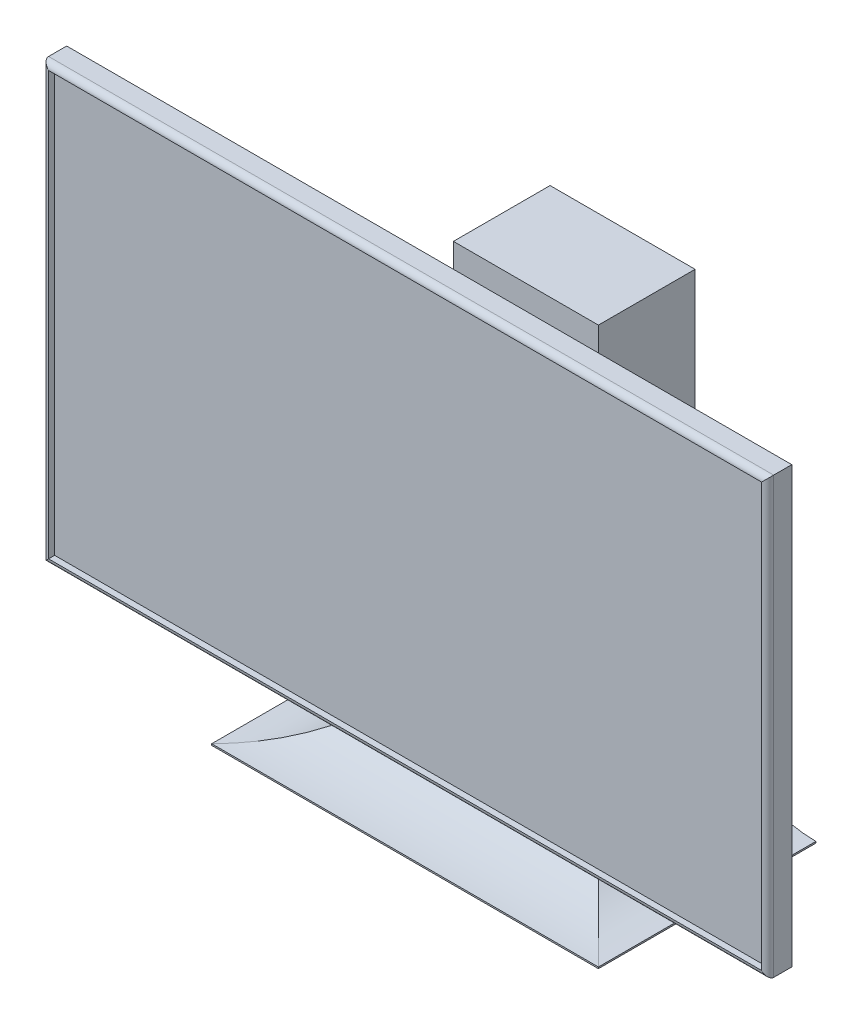
ISO-10303-21;
HEADER;
FILE_DESCRIPTION(('STEP AP214'),'2;1');
FILE_NAME('part.step','',(''),(''),'','','');
FILE_SCHEMA(('AUTOMOTIVE_DESIGN { 1 0 10303 214 1 1 1 1 }'));
ENDSEC;
DATA;
#1=APPLICATION_CONTEXT('core data for automotive mechanical design processes');
#2=APPLICATION_PROTOCOL_DEFINITION('international standard','automotive_design',2000,#1);
#3=PRODUCT_CONTEXT('',#1,'mechanical');
#4=PRODUCT('Part','Part','',(#3));
#5=PRODUCT_RELATED_PRODUCT_CATEGORY('part','',(#4));
#6=PRODUCT_DEFINITION_FORMATION('','',#4);
#7=PRODUCT_DEFINITION_CONTEXT('part definition',#1,'design');
#8=PRODUCT_DEFINITION('design','',#6,#7);
#9=PRODUCT_DEFINITION_SHAPE('','',#8);
#10=(LENGTH_UNIT() NAMED_UNIT(*) SI_UNIT(.MILLI.,.METRE.));
#11=(NAMED_UNIT(*) PLANE_ANGLE_UNIT() SI_UNIT($,.RADIAN.));
#12=(NAMED_UNIT(*) SI_UNIT($,.STERADIAN.) SOLID_ANGLE_UNIT());
#13=UNCERTAINTY_MEASURE_WITH_UNIT(LENGTH_MEASURE(1.E-05),#10,'distance_accuracy_value','');
#14=(GEOMETRIC_REPRESENTATION_CONTEXT(3) GLOBAL_UNCERTAINTY_ASSIGNED_CONTEXT((#13)) GLOBAL_UNIT_ASSIGNED_CONTEXT((#10,
#11,#12)) REPRESENTATION_CONTEXT('',''));
#15=CARTESIAN_POINT('',(0.,0.,0.));
#16=DIRECTION('',(0.,0.,1.));
#17=DIRECTION('',(1.,0.,0.));
#18=AXIS2_PLACEMENT_3D('',#15,#16,#17);
#19=CARTESIAN_POINT('',(63.5,102.39375,-63.5));
#20=DIRECTION('',(0.,0.,-1.));
#21=DIRECTION('',(-1.,0.,0.));
#22=AXIS2_PLACEMENT_3D('',#19,#20,#21);
#23=PLANE('',#22);
#24=DIRECTION('',(1.,0.,0.));
#25=VECTOR('',#24,1.);
#26=CARTESIAN_POINT('',(63.5,102.39375,-63.5));
#27=LINE('',#26,#25);
#28=CARTESIAN_POINT('',(63.5,102.39375,-63.5));
#29=VERTEX_POINT('',#28);
#30=CARTESIAN_POINT('',(139.7,102.39375,-63.5));
#31=VERTEX_POINT('',#30);
#32=EDGE_CURVE('E226',#29,#31,#27,.T.);
#33=ORIENTED_EDGE('',*,*,#32,.F.);
#34=DIRECTION('',(0.,-1.,0.));
#35=VECTOR('',#34,1.);
#36=CARTESIAN_POINT('',(63.5,102.39375,-63.5));
#37=LINE('',#36,#35);
#38=CARTESIAN_POINT('',(63.5,64.29375,-63.5));
#39=VERTEX_POINT('',#38);
#40=EDGE_CURVE('E272',#29,#39,#37,.T.);
#41=ORIENTED_EDGE('',*,*,#40,.T.);
#42=DIRECTION('',(1.,0.,0.));
#43=VECTOR('',#42,1.);
#44=CARTESIAN_POINT('',(139.7,64.29375,-63.5));
#45=LINE('',#44,#43);
#46=CARTESIAN_POINT('',(139.7,64.29375,-63.5));
#47=VERTEX_POINT('',#46);
#48=EDGE_CURVE('E318',#39,#47,#45,.T.);
#49=ORIENTED_EDGE('',*,*,#48,.T.);
#50=DIRECTION('',(0.,-1.,0.));
#51=VECTOR('',#50,1.);
#52=CARTESIAN_POINT('',(139.7,102.39375,-63.5));
#53=LINE('',#52,#51);
#54=EDGE_CURVE('E273',#31,#47,#53,.T.);
#55=ORIENTED_EDGE('',*,*,#54,.F.);
#56=EDGE_LOOP('',(#33,#41,#49,#55));
#57=FACE_BOUND('',#56,.T.);
#58=ADVANCED_FACE('F34',(#57),#23,.F.);
#59=DIRECTION('',(-1.,0.,0.));
#60=VECTOR('',#59,1.);
#61=CARTESIAN_POINT('',(63.5,140.49375,-63.5));
#62=LINE('',#61,#60);
#63=CARTESIAN_POINT('',(139.7,140.49375,-63.5));
#64=VERTEX_POINT('',#63);
#65=CARTESIAN_POINT('',(63.5,140.49375,-63.5));
#66=VERTEX_POINT('',#65);
#67=EDGE_CURVE('E231',#64,#66,#62,.T.);
#68=ORIENTED_EDGE('',*,*,#67,.F.);
#69=CARTESIAN_POINT('',(139.7,229.39375,-63.5));
#70=VERTEX_POINT('',#69);
#71=EDGE_CURVE('E269',#70,#64,#53,.T.);
#72=ORIENTED_EDGE('',*,*,#71,.F.);
#73=DIRECTION('',(1.,0.,0.));
#74=VECTOR('',#73,1.);
#75=CARTESIAN_POINT('',(139.7,229.39375,-63.5));
#76=LINE('',#75,#74);
#77=CARTESIAN_POINT('',(63.5,229.39375,-63.5));
#78=VERTEX_POINT('',#77);
#79=EDGE_CURVE('E265',#78,#70,#76,.T.);
#80=ORIENTED_EDGE('',*,*,#79,.F.);
#81=EDGE_CURVE('E274',#78,#66,#37,.T.);
#82=ORIENTED_EDGE('',*,*,#81,.T.);
#83=EDGE_LOOP('',(#68,#72,#80,#82));
#84=FACE_BOUND('',#83,.T.);
#85=ADVANCED_FACE('F386',(#84),#23,.F.);
#86=CARTESIAN_POINT('',(0.,0.79375,0.));
#87=DIRECTION('',(1.,0.,0.));
#88=DIRECTION('',(0.,0.,-1.));
#89=AXIS2_PLACEMENT_3D('',#86,#87,#88);
#90=PLANE('',#89);
#91=DIRECTION('',(0.,0.,1.));
#92=VECTOR('',#91,1.);
#93=CARTESIAN_POINT('',(0.,0.,0.));
#94=LINE('',#93,#92);
#95=CARTESIAN_POINT('',(0.,0.,-114.3));
#96=VERTEX_POINT('',#95);
#97=CARTESIAN_POINT('',(0.,0.,0.));
#98=VERTEX_POINT('',#97);
#99=EDGE_CURVE('E282',#96,#98,#94,.T.);
#100=ORIENTED_EDGE('',*,*,#99,.T.);
#101=DIRECTION('',(0.,-1.,0.));
#102=VECTOR('',#101,1.);
#103=CARTESIAN_POINT('',(0.,0.79375,0.));
#104=LINE('',#103,#102);
#105=CARTESIAN_POINT('',(0.,0.79375,0.));
#106=VERTEX_POINT('',#105);
#107=EDGE_CURVE('E309',#106,#98,#104,.T.);
#108=ORIENTED_EDGE('',*,*,#107,.F.);
#109=DIRECTION('',(0.,0.,1.));
#110=VECTOR('',#109,1.);
#111=CARTESIAN_POINT('',(0.,0.79375,0.));
#112=LINE('',#111,#110);
#113=CARTESIAN_POINT('',(0.,0.79375,-114.3));
#114=VERTEX_POINT('',#113);
#115=EDGE_CURVE('E283',#114,#106,#112,.T.);
#116=ORIENTED_EDGE('',*,*,#115,.F.);
#117=DIRECTION('',(0.,-1.,0.));
#118=VECTOR('',#117,1.);
#119=CARTESIAN_POINT('',(0.,0.79375,-114.3));
#120=LINE('',#119,#118);
#121=EDGE_CURVE('E293',#114,#96,#120,.T.);
#122=ORIENTED_EDGE('',*,*,#121,.T.);
#123=EDGE_LOOP('',(#100,#108,#116,#122));
#124=FACE_BOUND('',#123,.T.);
#125=ADVANCED_FACE('F392',(#124),#90,.F.);
#126=CARTESIAN_POINT('',(0.,0.79375,0.));
#127=DIRECTION('',(0.,0.,-1.));
#128=DIRECTION('',(-1.,0.,0.));
#129=AXIS2_PLACEMENT_3D('',#126,#127,#128);
#130=PLANE('',#129);
#131=DIRECTION('',(1.,0.,0.));
#132=VECTOR('',#131,1.);
#133=CARTESIAN_POINT('',(0.,0.,0.));
#134=LINE('',#133,#132);
#135=CARTESIAN_POINT('',(203.2,0.,0.));
#136=VERTEX_POINT('',#135);
#137=EDGE_CURVE('E296',#98,#136,#134,.T.);
#138=ORIENTED_EDGE('',*,*,#137,.T.);
#139=DIRECTION('',(0.,-1.,0.));
#140=VECTOR('',#139,1.);
#141=CARTESIAN_POINT('',(203.2,0.79375,0.));
#142=LINE('',#141,#140);
#143=CARTESIAN_POINT('',(203.2,0.79375,0.));
#144=VERTEX_POINT('',#143);
#145=EDGE_CURVE('E306',#144,#136,#142,.T.);
#146=ORIENTED_EDGE('',*,*,#145,.F.);
#147=DIRECTION('',(1.,0.,0.));
#148=VECTOR('',#147,1.);
#149=CARTESIAN_POINT('',(0.,0.79375,0.));
#150=LINE('',#149,#148);
#151=EDGE_CURVE('E286',#106,#144,#150,.T.);
#152=ORIENTED_EDGE('',*,*,#151,.F.);
#153=ORIENTED_EDGE('',*,*,#107,.T.);
#154=EDGE_LOOP('',(#138,#146,#152,#153));
#155=FACE_BOUND('',#154,.T.);
#156=ADVANCED_FACE('F418',(#155),#130,.F.);
#157=CARTESIAN_POINT('',(203.2,0.79375,0.));
#158=DIRECTION('',(-1.,0.,0.));
#159=DIRECTION('',(0.,0.,1.));
#160=AXIS2_PLACEMENT_3D('',#157,#158,#159);
#161=PLANE('',#160);
#162=DIRECTION('',(0.,0.,-1.));
#163=VECTOR('',#162,1.);
#164=CARTESIAN_POINT('',(203.2,0.,0.));
#165=LINE('',#164,#163);
#166=CARTESIAN_POINT('',(203.2,0.,-114.3));
#167=VERTEX_POINT('',#166);
#168=EDGE_CURVE('E298',#136,#167,#165,.T.);
#169=ORIENTED_EDGE('',*,*,#168,.T.);
#170=DIRECTION('',(0.,-1.,0.));
#171=VECTOR('',#170,1.);
#172=CARTESIAN_POINT('',(203.2,0.79375,-114.3));
#173=LINE('',#172,#171);
#174=CARTESIAN_POINT('',(203.2,0.79375,-114.3));
#175=VERTEX_POINT('',#174);
#176=EDGE_CURVE('E303',#175,#167,#173,.T.);
#177=ORIENTED_EDGE('',*,*,#176,.F.);
#178=DIRECTION('',(0.,0.,-1.));
#179=VECTOR('',#178,1.);
#180=CARTESIAN_POINT('',(203.2,0.79375,0.));
#181=LINE('',#180,#179);
#182=EDGE_CURVE('E290',#144,#175,#181,.T.);
#183=ORIENTED_EDGE('',*,*,#182,.F.);
#184=ORIENTED_EDGE('',*,*,#145,.T.);
#185=EDGE_LOOP('',(#169,#177,#183,#184));
#186=FACE_BOUND('',#185,.T.);
#187=ADVANCED_FACE('F414',(#186),#161,.F.);
#188=CARTESIAN_POINT('',(0.,0.79375,-114.3));
#189=DIRECTION('',(0.,0.,1.));
#190=DIRECTION('',(1.,0.,0.));
#191=AXIS2_PLACEMENT_3D('',#188,#189,#190);
#192=PLANE('',#191);
#193=DIRECTION('',(-1.,0.,0.));
#194=VECTOR('',#193,1.);
#195=CARTESIAN_POINT('',(0.,0.,-114.3));
#196=LINE('',#195,#194);
#197=EDGE_CURVE('E287',#167,#96,#196,.T.);
#198=ORIENTED_EDGE('',*,*,#197,.T.);
#199=ORIENTED_EDGE('',*,*,#121,.F.);
#200=CARTESIAN_POINT('',(0.,64.29375,-114.3));
#201=DIRECTION('',(0.,0.,1.));
#202=DIRECTION('',(1.,0.,0.));
#203=AXIS2_PLACEMENT_3D('',#200,#201,#202);
#204=CIRCLE('',#203,63.5);
#205=CARTESIAN_POINT('',(63.5,64.29375,-114.3));
#206=VERTEX_POINT('',#205);
#207=EDGE_CURVE('E323',#114,#206,#204,.T.);
#208=ORIENTED_EDGE('',*,*,#207,.T.);
#209=DIRECTION('',(0.,-1.,0.));
#210=VECTOR('',#209,1.);
#211=CARTESIAN_POINT('',(63.5,102.39375,-114.3));
#212=LINE('',#211,#210);
#213=CARTESIAN_POINT('',(63.5,229.39375,-114.3));
#214=VERTEX_POINT('',#213);
#215=EDGE_CURVE('E276',#214,#206,#212,.T.);
#216=ORIENTED_EDGE('',*,*,#215,.F.);
#217=DIRECTION('',(-1.,0.,0.));
#218=VECTOR('',#217,1.);
#219=CARTESIAN_POINT('',(139.7,229.39375,-114.3));
#220=LINE('',#219,#218);
#221=CARTESIAN_POINT('',(139.7,229.39375,-114.3));
#222=VERTEX_POINT('',#221);
#223=EDGE_CURVE('E259',#222,#214,#220,.T.);
#224=ORIENTED_EDGE('',*,*,#223,.F.);
#225=DIRECTION('',(0.,-1.,0.));
#226=VECTOR('',#225,1.);
#227=CARTESIAN_POINT('',(139.7,102.39375,-114.3));
#228=LINE('',#227,#226);
#229=CARTESIAN_POINT('',(139.7,64.29375,-114.3));
#230=VERTEX_POINT('',#229);
#231=EDGE_CURVE('E279',#222,#230,#228,.T.);
#232=ORIENTED_EDGE('',*,*,#231,.T.);
#233=CARTESIAN_POINT('',(203.2,64.29375,-114.3));
#234=DIRECTION('',(0.,0.,1.));
#235=DIRECTION('',(1.,0.,0.));
#236=AXIS2_PLACEMENT_3D('',#233,#234,#235);
#237=CIRCLE('',#236,63.5);
#238=EDGE_CURVE('E321',#230,#175,#237,.T.);
#239=ORIENTED_EDGE('',*,*,#238,.T.);
#240=ORIENTED_EDGE('',*,*,#176,.T.);
#241=EDGE_LOOP('',(#198,#199,#208,#216,#224,#232,#239,#240));
#242=FACE_BOUND('',#241,.T.);
#243=ADVANCED_FACE('F410',(#242),#192,.F.);
#244=CARTESIAN_POINT('',(0.,0.,0.));
#245=DIRECTION('',(0.,-1.,0.));
#246=DIRECTION('',(0.,0.,-1.));
#247=AXIS2_PLACEMENT_3D('',#244,#245,#246);
#248=PLANE('',#247);
#249=ORIENTED_EDGE('',*,*,#99,.F.);
#250=ORIENTED_EDGE('',*,*,#197,.F.);
#251=ORIENTED_EDGE('',*,*,#168,.F.);
#252=ORIENTED_EDGE('',*,*,#137,.F.);
#253=EDGE_LOOP('',(#249,#250,#251,#252));
#254=FACE_BOUND('',#253,.T.);
#255=ADVANCED_FACE('F406',(#254),#248,.T.);
#256=CARTESIAN_POINT('',(139.7,102.39375,-63.5));
#257=DIRECTION('',(-1.,0.,0.));
#258=DIRECTION('',(0.,0.,1.));
#259=AXIS2_PLACEMENT_3D('',#256,#257,#258);
#260=PLANE('',#259);
#261=ORIENTED_EDGE('',*,*,#71,.T.);
#262=DIRECTION('',(0.,0.,-1.));
#263=VECTOR('',#262,1.);
#264=CARTESIAN_POINT('',(139.7,140.49375,-12.7));
#265=LINE('',#264,#263);
#266=CARTESIAN_POINT('',(139.7,140.49375,-12.7));
#267=VERTEX_POINT('',#266);
#268=EDGE_CURVE('E247',#267,#64,#265,.T.);
#269=ORIENTED_EDGE('',*,*,#268,.F.);
#270=DIRECTION('',(0.,1.,0.));
#271=VECTOR('',#270,1.);
#272=CARTESIAN_POINT('',(139.7,102.39375,-12.7));
#273=LINE('',#272,#271);
#274=CARTESIAN_POINT('',(139.7,102.39375,-12.7));
#275=VERTEX_POINT('',#274);
#276=EDGE_CURVE('E234',#275,#267,#273,.T.);
#277=ORIENTED_EDGE('',*,*,#276,.F.);
#278=DIRECTION('',(0.,0.,-1.));
#279=VECTOR('',#278,1.);
#280=CARTESIAN_POINT('',(139.7,102.39375,-12.7));
#281=LINE('',#280,#279);
#282=EDGE_CURVE('E250',#275,#31,#281,.T.);
#283=ORIENTED_EDGE('',*,*,#282,.T.);
#284=ORIENTED_EDGE('',*,*,#54,.T.);
#285=DIRECTION('',(0.,0.,-1.));
#286=VECTOR('',#285,1.);
#287=CARTESIAN_POINT('',(139.7,64.29375,-114.3));
#288=LINE('',#287,#286);
#289=EDGE_CURVE('E312',#47,#230,#288,.T.);
#290=ORIENTED_EDGE('',*,*,#289,.T.);
#291=ORIENTED_EDGE('',*,*,#231,.F.);
#292=DIRECTION('',(0.,0.,-1.));
#293=VECTOR('',#292,1.);
#294=CARTESIAN_POINT('',(139.7,229.39375,-114.3));
#295=LINE('',#294,#293);
#296=EDGE_CURVE('E256',#70,#222,#295,.T.);
#297=ORIENTED_EDGE('',*,*,#296,.F.);
#298=EDGE_LOOP('',(#261,#269,#277,#283,#284,#290,#291,#297));
#299=FACE_BOUND('',#298,.T.);
#300=ADVANCED_FACE('F402',(#299),#260,.F.);
#301=CARTESIAN_POINT('',(63.5,102.39375,-63.5));
#302=DIRECTION('',(1.,0.,0.));
#303=DIRECTION('',(0.,0.,-1.));
#304=AXIS2_PLACEMENT_3D('',#301,#302,#303);
#305=PLANE('',#304);
#306=ORIENTED_EDGE('',*,*,#215,.T.);
#307=DIRECTION('',(0.,0.,1.));
#308=VECTOR('',#307,1.);
#309=CARTESIAN_POINT('',(63.5,64.29375,-63.5));
#310=LINE('',#309,#308);
#311=EDGE_CURVE('E315',#206,#39,#310,.T.);
#312=ORIENTED_EDGE('',*,*,#311,.T.);
#313=ORIENTED_EDGE('',*,*,#40,.F.);
#314=DIRECTION('',(0.,0.,-1.));
#315=VECTOR('',#314,1.);
#316=CARTESIAN_POINT('',(63.5,102.39375,-12.7));
#317=LINE('',#316,#315);
#318=CARTESIAN_POINT('',(63.5,102.39375,-12.7));
#319=VERTEX_POINT('',#318);
#320=EDGE_CURVE('E253',#319,#29,#317,.T.);
#321=ORIENTED_EDGE('',*,*,#320,.F.);
#322=DIRECTION('',(0.,-1.,0.));
#323=VECTOR('',#322,1.);
#324=CARTESIAN_POINT('',(63.5,102.39375,-12.7));
#325=LINE('',#324,#323);
#326=CARTESIAN_POINT('',(63.5,140.49375,-12.7));
#327=VERTEX_POINT('',#326);
#328=EDGE_CURVE('E227',#327,#319,#325,.T.);
#329=ORIENTED_EDGE('',*,*,#328,.F.);
#330=DIRECTION('',(0.,0.,-1.));
#331=VECTOR('',#330,1.);
#332=CARTESIAN_POINT('',(63.5,140.49375,-12.7));
#333=LINE('',#332,#331);
#334=EDGE_CURVE('E240',#327,#66,#333,.T.);
#335=ORIENTED_EDGE('',*,*,#334,.T.);
#336=ORIENTED_EDGE('',*,*,#81,.F.);
#337=DIRECTION('',(0.,0.,1.));
#338=VECTOR('',#337,1.);
#339=CARTESIAN_POINT('',(63.5,229.39375,-114.3));
#340=LINE('',#339,#338);
#341=EDGE_CURVE('E262',#214,#78,#340,.T.);
#342=ORIENTED_EDGE('',*,*,#341,.F.);
#343=EDGE_LOOP('',(#306,#312,#313,#321,#329,#335,#336,#342));
#344=FACE_BOUND('',#343,.T.);
#345=ADVANCED_FACE('F398',(#344),#305,.F.);
#346=CARTESIAN_POINT('',(0.,64.29375,-63.5));
#347=DIRECTION('',(0.,0.,-1.));
#348=DIRECTION('',(-1.,0.,0.));
#349=AXIS2_PLACEMENT_3D('',#346,#347,#348);
#350=CYLINDRICAL_SURFACE('',#349,63.5);
#351=ORIENTED_EDGE('',*,*,#207,.F.);
#352=ORIENTED_EDGE('',*,*,#115,.T.);
#353=CARTESIAN_POINT('',(0.,64.29375,0.));
#354=DIRECTION('',(-0.707106781186548,0.,-0.707106781186548));
#355=DIRECTION('',(-0.707106781186547,0.,0.707106781186547));
#356=AXIS2_PLACEMENT_3D('',#353,#354,#355);
#357=ELLIPSE('',#356,89.8025612106916,63.5);
#358=EDGE_CURVE('E328',#39,#106,#357,.T.);
#359=ORIENTED_EDGE('',*,*,#358,.F.);
#360=ORIENTED_EDGE('',*,*,#311,.F.);
#361=EDGE_LOOP('',(#351,#352,#359,#360));
#362=FACE_BOUND('',#361,.T.);
#363=ADVANCED_FACE('F401',(#362),#350,.F.);
#364=CARTESIAN_POINT('',(63.5,64.29375,0.));
#365=DIRECTION('',(-1.,0.,0.));
#366=DIRECTION('',(0.,0.,1.));
#367=AXIS2_PLACEMENT_3D('',#364,#365,#366);
#368=CYLINDRICAL_SURFACE('',#367,63.5);
#369=ORIENTED_EDGE('',*,*,#358,.T.);
#370=ORIENTED_EDGE('',*,*,#151,.T.);
#371=CARTESIAN_POINT('',(203.2,64.29375,0.));
#372=DIRECTION('',(-0.707106781186547,0.,0.707106781186548));
#373=DIRECTION('',(-0.707106781186548,0.,-0.707106781186547));
#374=AXIS2_PLACEMENT_3D('',#371,#372,#373);
#375=ELLIPSE('',#374,89.8025612106915,63.5);
#376=EDGE_CURVE('E268',#47,#144,#375,.T.);
#377=ORIENTED_EDGE('',*,*,#376,.F.);
#378=ORIENTED_EDGE('',*,*,#48,.F.);
#379=EDGE_LOOP('',(#369,#370,#377,#378));
#380=FACE_BOUND('',#379,.T.);
#381=ADVANCED_FACE('F429',(#380),#368,.F.);
#382=CARTESIAN_POINT('',(203.2,64.29375,-63.5));
#383=DIRECTION('',(0.,0.,1.));
#384=DIRECTION('',(1.,0.,0.));
#385=AXIS2_PLACEMENT_3D('',#382,#383,#384);
#386=CYLINDRICAL_SURFACE('',#385,63.5);
#387=ORIENTED_EDGE('',*,*,#376,.T.);
#388=ORIENTED_EDGE('',*,*,#182,.T.);
#389=ORIENTED_EDGE('',*,*,#238,.F.);
#390=ORIENTED_EDGE('',*,*,#289,.F.);
#391=EDGE_LOOP('',(#387,#388,#389,#390));
#392=FACE_BOUND('',#391,.T.);
#393=ADVANCED_FACE('F426',(#392),#386,.F.);
#394=CARTESIAN_POINT('',(0.,229.39375,0.));
#395=DIRECTION('',(0.,-1.,0.));
#396=DIRECTION('',(0.,0.,-1.));
#397=AXIS2_PLACEMENT_3D('',#394,#395,#396);
#398=PLANE('',#397);
#399=ORIENTED_EDGE('',*,*,#296,.T.);
#400=ORIENTED_EDGE('',*,*,#223,.T.);
#401=ORIENTED_EDGE('',*,*,#341,.T.);
#402=ORIENTED_EDGE('',*,*,#79,.T.);
#403=EDGE_LOOP('',(#399,#400,#401,#402));
#404=FACE_BOUND('',#403,.T.);
#405=ADVANCED_FACE('F396',(#404),#398,.F.);
#406=CARTESIAN_POINT('',(63.5,102.39375,-12.7));
#407=DIRECTION('',(0.,1.,0.));
#408=DIRECTION('',(0.,0.,1.));
#409=AXIS2_PLACEMENT_3D('',#406,#407,#408);
#410=PLANE('',#409);
#411=ORIENTED_EDGE('',*,*,#32,.T.);
#412=ORIENTED_EDGE('',*,*,#282,.F.);
#413=DIRECTION('',(1.,0.,0.));
#414=VECTOR('',#413,1.);
#415=CARTESIAN_POINT('',(63.5,102.39375,-12.7));
#416=LINE('',#415,#414);
#417=EDGE_CURVE('E230',#319,#275,#416,.T.);
#418=ORIENTED_EDGE('',*,*,#417,.F.);
#419=ORIENTED_EDGE('',*,*,#320,.T.);
#420=EDGE_LOOP('',(#411,#412,#418,#419));
#421=FACE_BOUND('',#420,.T.);
#422=ADVANCED_FACE('F463',(#421),#410,.F.);
#423=CARTESIAN_POINT('',(63.5,140.49375,-12.7));
#424=DIRECTION('',(0.,-1.,0.));
#425=DIRECTION('',(0.,0.,-1.));
#426=AXIS2_PLACEMENT_3D('',#423,#424,#425);
#427=PLANE('',#426);
#428=ORIENTED_EDGE('',*,*,#67,.T.);
#429=ORIENTED_EDGE('',*,*,#334,.F.);
#430=DIRECTION('',(-1.,0.,0.));
#431=VECTOR('',#430,1.);
#432=CARTESIAN_POINT('',(63.5,140.49375,-12.7));
#433=LINE('',#432,#431);
#434=EDGE_CURVE('E237',#267,#327,#433,.T.);
#435=ORIENTED_EDGE('',*,*,#434,.F.);
#436=ORIENTED_EDGE('',*,*,#268,.T.);
#437=EDGE_LOOP('',(#428,#429,#435,#436));
#438=FACE_BOUND('',#437,.T.);
#439=ADVANCED_FACE('F461',(#438),#427,.F.);
#440=CARTESIAN_POINT('',(0.,0.,-12.7));
#441=DIRECTION('',(0.,0.,-1.));
#442=DIRECTION('',(-1.,0.,0.));
#443=AXIS2_PLACEMENT_3D('',#440,#441,#442);
#444=PLANE('',#443);
#445=DIRECTION('',(0.,1.,0.));
#446=VECTOR('',#445,1.);
#447=CARTESIAN_POINT('',(292.1,38.89375,-12.7));
#448=LINE('',#447,#446);
#449=CARTESIAN_POINT('',(292.1,38.89375,-12.7));
#450=VERTEX_POINT('',#449);
#451=CARTESIAN_POINT('',(292.1,267.49375,-12.7));
#452=VERTEX_POINT('',#451);
#453=EDGE_CURVE('E206',#450,#452,#448,.T.);
#454=ORIENTED_EDGE('',*,*,#453,.F.);
#455=DIRECTION('',(1.,0.,0.));
#456=VECTOR('',#455,1.);
#457=CARTESIAN_POINT('',(-88.9,38.89375,-12.7));
#458=LINE('',#457,#456);
#459=CARTESIAN_POINT('',(-88.9,38.89375,-12.7));
#460=VERTEX_POINT('',#459);
#461=EDGE_CURVE('E215',#460,#450,#458,.T.);
#462=ORIENTED_EDGE('',*,*,#461,.F.);
#463=DIRECTION('',(0.,-1.,0.));
#464=VECTOR('',#463,1.);
#465=CARTESIAN_POINT('',(-88.9,38.89375,-12.7));
#466=LINE('',#465,#464);
#467=CARTESIAN_POINT('',(-88.9,267.49375,-12.7));
#468=VERTEX_POINT('',#467);
#469=EDGE_CURVE('E212',#468,#460,#466,.T.);
#470=ORIENTED_EDGE('',*,*,#469,.F.);
#471=DIRECTION('',(-1.,0.,0.));
#472=VECTOR('',#471,1.);
#473=CARTESIAN_POINT('',(-88.9,267.49375,-12.7));
#474=LINE('',#473,#472);
#475=EDGE_CURVE('E209',#452,#468,#474,.T.);
#476=ORIENTED_EDGE('',*,*,#475,.F.);
#477=EDGE_LOOP('',(#454,#462,#470,#476));
#478=FACE_BOUND('',#477,.T.);
#479=ORIENTED_EDGE('',*,*,#417,.T.);
#480=ORIENTED_EDGE('',*,*,#276,.T.);
#481=ORIENTED_EDGE('',*,*,#434,.T.);
#482=ORIENTED_EDGE('',*,*,#328,.T.);
#483=EDGE_LOOP('',(#479,#480,#481,#482));
#484=FACE_BOUND('',#483,.T.);
#485=ADVANCED_FACE('F455',(#478,#484),#444,.T.);
#486=CARTESIAN_POINT('',(292.1,38.89375,0.));
#487=DIRECTION('',(-1.,0.,0.));
#488=DIRECTION('',(0.,0.,1.));
#489=AXIS2_PLACEMENT_3D('',#486,#487,#488);
#490=PLANE('',#489);
#491=DIRECTION('',(0.,0.,-1.));
#492=VECTOR('',#491,1.);
#493=CARTESIAN_POINT('',(292.1,267.49375,0.));
#494=LINE('',#493,#492);
#495=CARTESIAN_POINT('',(292.1,267.49375,-3.17500000000003));
#496=VERTEX_POINT('',#495);
#497=EDGE_CURVE('E224',#496,#452,#494,.T.);
#498=ORIENTED_EDGE('',*,*,#497,.F.);
#499=DIRECTION('',(0.,1.,0.));
#500=VECTOR('',#499,1.);
#501=CARTESIAN_POINT('',(292.1,38.89375,-3.17500000000003));
#502=LINE('',#501,#500);
#503=CARTESIAN_POINT('',(292.1,38.89375,-3.17500000000003));
#504=VERTEX_POINT('',#503);
#505=EDGE_CURVE('E11',#496,#504,#502,.F.);
#506=ORIENTED_EDGE('',*,*,#505,.T.);
#507=DIRECTION('',(0.,0.,-1.));
#508=VECTOR('',#507,1.);
#509=CARTESIAN_POINT('',(292.1,38.89375,0.));
#510=LINE('',#509,#508);
#511=EDGE_CURVE('E218',#504,#450,#510,.T.);
#512=ORIENTED_EDGE('',*,*,#511,.T.);
#513=ORIENTED_EDGE('',*,*,#453,.T.);
#514=EDGE_LOOP('',(#498,#506,#512,#513));
#515=FACE_BOUND('',#514,.T.);
#516=ADVANCED_FACE('F363',(#515),#490,.F.);
#517=CARTESIAN_POINT('',(-88.9,267.49375,0.));
#518=DIRECTION('',(0.,-1.,0.));
#519=DIRECTION('',(0.,0.,-1.));
#520=AXIS2_PLACEMENT_3D('',#517,#518,#519);
#521=PLANE('',#520);
#522=DIRECTION('',(0.,0.,-1.));
#523=VECTOR('',#522,1.);
#524=CARTESIAN_POINT('',(-88.9,267.49375,0.));
#525=LINE('',#524,#523);
#526=CARTESIAN_POINT('',(-88.9,267.49375,-3.17500000000003));
#527=VERTEX_POINT('',#526);
#528=EDGE_CURVE('E222',#527,#468,#525,.T.);
#529=ORIENTED_EDGE('',*,*,#528,.F.);
#530=DIRECTION('',(-1.,0.,0.));
#531=VECTOR('',#530,1.);
#532=CARTESIAN_POINT('',(-88.9,267.49375,-3.17500000000003));
#533=LINE('',#532,#531);
#534=EDGE_CURVE('E43',#527,#496,#533,.F.);
#535=ORIENTED_EDGE('',*,*,#534,.T.);
#536=ORIENTED_EDGE('',*,*,#497,.T.);
#537=ORIENTED_EDGE('',*,*,#475,.T.);
#538=EDGE_LOOP('',(#529,#535,#536,#537));
#539=FACE_BOUND('',#538,.T.);
#540=ADVANCED_FACE('F452',(#539),#521,.F.);
#541=CARTESIAN_POINT('',(-88.9,38.89375,0.));
#542=DIRECTION('',(1.,0.,0.));
#543=DIRECTION('',(0.,0.,-1.));
#544=AXIS2_PLACEMENT_3D('',#541,#542,#543);
#545=PLANE('',#544);
#546=DIRECTION('',(0.,0.,-1.));
#547=VECTOR('',#546,1.);
#548=CARTESIAN_POINT('',(-88.9,38.89375,0.));
#549=LINE('',#548,#547);
#550=CARTESIAN_POINT('',(-88.9,38.89375,-3.17500000000003));
#551=VERTEX_POINT('',#550);
#552=EDGE_CURVE('E220',#551,#460,#549,.T.);
#553=ORIENTED_EDGE('',*,*,#552,.F.);
#554=DIRECTION('',(0.,-1.,0.));
#555=VECTOR('',#554,1.);
#556=CARTESIAN_POINT('',(-88.9,38.89375,-3.17500000000003));
#557=LINE('',#556,#555);
#558=EDGE_CURVE('E58',#551,#527,#557,.F.);
#559=ORIENTED_EDGE('',*,*,#558,.T.);
#560=ORIENTED_EDGE('',*,*,#528,.T.);
#561=ORIENTED_EDGE('',*,*,#469,.T.);
#562=EDGE_LOOP('',(#553,#559,#560,#561));
#563=FACE_BOUND('',#562,.T.);
#564=ADVANCED_FACE('F447',(#563),#545,.F.);
#565=CARTESIAN_POINT('',(-88.9,38.89375,0.));
#566=DIRECTION('',(0.,1.,0.));
#567=DIRECTION('',(0.,0.,1.));
#568=AXIS2_PLACEMENT_3D('',#565,#566,#567);
#569=PLANE('',#568);
#570=ORIENTED_EDGE('',*,*,#511,.F.);
#571=DIRECTION('',(1.,0.,0.));
#572=VECTOR('',#571,1.);
#573=CARTESIAN_POINT('',(-88.9,38.89375,-3.17500000000003));
#574=LINE('',#573,#572);
#575=EDGE_CURVE('E339',#504,#551,#574,.F.);
#576=ORIENTED_EDGE('',*,*,#575,.T.);
#577=ORIENTED_EDGE('',*,*,#552,.T.);
#578=ORIENTED_EDGE('',*,*,#461,.T.);
#579=EDGE_LOOP('',(#570,#576,#577,#578));
#580=FACE_BOUND('',#579,.T.);
#581=ADVANCED_FACE('F366',(#580),#569,.F.);
#582=CARTESIAN_POINT('',(0.,264.31875,-3.17500000000003));
#583=DIRECTION('',(-1.,0.,0.));
#584=DIRECTION('',(0.,0.,1.));
#585=AXIS2_PLACEMENT_3D('',#582,#583,#584);
#586=CYLINDRICAL_SURFACE('',#585,3.175);
#587=CARTESIAN_POINT('',(288.925,264.31875,-3.17500000000003));
#588=DIRECTION('',(-0.707106781186547,0.707106781186547,0.));
#589=DIRECTION('',(0.707106781186547,0.707106781186547,0.));
#590=AXIS2_PLACEMENT_3D('',#587,#588,#589);
#591=ELLIPSE('',#590,4.49012806053458,3.175);
#592=CARTESIAN_POINT('',(288.925,264.31875,0.));
#593=VERTEX_POINT('',#592);
#594=EDGE_CURVE('E347',#496,#593,#591,.F.);
#595=ORIENTED_EDGE('',*,*,#594,.F.);
#596=ORIENTED_EDGE('',*,*,#534,.F.);
#597=CARTESIAN_POINT('',(-85.725,264.31875,-3.17500000000003));
#598=DIRECTION('',(-0.707106781186547,-0.707106781186547,0.));
#599=DIRECTION('',(-0.707106781186547,0.707106781186547,0.));
#600=AXIS2_PLACEMENT_3D('',#597,#598,#599);
#601=ELLIPSE('',#600,4.49012806053458,3.175);
#602=CARTESIAN_POINT('',(-85.725,264.31875,0.));
#603=VERTEX_POINT('',#602);
#604=EDGE_CURVE('E38',#603,#527,#601,.T.);
#605=ORIENTED_EDGE('',*,*,#604,.F.);
#606=DIRECTION('',(-1.,0.,0.));
#607=VECTOR('',#606,1.);
#608=CARTESIAN_POINT('',(0.,264.31875,0.));
#609=LINE('',#608,#607);
#610=EDGE_CURVE('E333',#593,#603,#609,.T.);
#611=ORIENTED_EDGE('',*,*,#610,.F.);
#612=EDGE_LOOP('',(#595,#596,#605,#611));
#613=FACE_BOUND('',#612,.T.);
#614=ADVANCED_FACE('F36',(#613),#586,.T.);
#615=CARTESIAN_POINT('',(-85.725,0.,-3.17500000000003));
#616=DIRECTION('',(0.,-1.,0.));
#617=DIRECTION('',(0.,0.,-1.));
#618=AXIS2_PLACEMENT_3D('',#615,#616,#617);
#619=CYLINDRICAL_SURFACE('',#618,3.175);
#620=ORIENTED_EDGE('',*,*,#604,.T.);
#621=ORIENTED_EDGE('',*,*,#558,.F.);
#622=CARTESIAN_POINT('',(-85.725,42.06875,-3.17500000000003));
#623=DIRECTION('',(0.707106781186547,-0.707106781186547,0.));
#624=DIRECTION('',(-0.707106781186547,-0.707106781186547,0.));
#625=AXIS2_PLACEMENT_3D('',#622,#623,#624);
#626=ELLIPSE('',#625,4.49012806053458,3.175);
#627=CARTESIAN_POINT('',(-85.725,42.06875,0.));
#628=VERTEX_POINT('',#627);
#629=EDGE_CURVE('E346',#628,#551,#626,.T.);
#630=ORIENTED_EDGE('',*,*,#629,.F.);
#631=DIRECTION('',(0.,-1.,0.));
#632=VECTOR('',#631,1.);
#633=CARTESIAN_POINT('',(-85.725,0.,0.));
#634=LINE('',#633,#632);
#635=EDGE_CURVE('E179',#603,#628,#634,.T.);
#636=ORIENTED_EDGE('',*,*,#635,.F.);
#637=EDGE_LOOP('',(#620,#621,#630,#636));
#638=FACE_BOUND('',#637,.T.);
#639=ADVANCED_FACE('F356',(#638),#619,.T.);
#640=CARTESIAN_POINT('',(288.925,0.,-3.17500000000003));
#641=DIRECTION('',(0.,1.,0.));
#642=DIRECTION('',(0.,0.,1.));
#643=AXIS2_PLACEMENT_3D('',#640,#641,#642);
#644=CYLINDRICAL_SURFACE('',#643,3.175);
#645=ORIENTED_EDGE('',*,*,#594,.T.);
#646=DIRECTION('',(0.,1.,0.));
#647=VECTOR('',#646,1.);
#648=CARTESIAN_POINT('',(288.925,0.,0.));
#649=LINE('',#648,#647);
#650=CARTESIAN_POINT('',(288.925,42.06875,0.));
#651=VERTEX_POINT('',#650);
#652=EDGE_CURVE('E325',#651,#593,#649,.T.);
#653=ORIENTED_EDGE('',*,*,#652,.F.);
#654=CARTESIAN_POINT('',(288.925,42.06875,-3.17500000000003));
#655=DIRECTION('',(0.707106781186547,0.707106781186547,0.));
#656=DIRECTION('',(-0.707106781186547,0.707106781186547,0.));
#657=AXIS2_PLACEMENT_3D('',#654,#655,#656);
#658=ELLIPSE('',#657,4.49012806053458,3.175);
#659=EDGE_CURVE('E202',#504,#651,#658,.F.);
#660=ORIENTED_EDGE('',*,*,#659,.F.);
#661=ORIENTED_EDGE('',*,*,#505,.F.);
#662=EDGE_LOOP('',(#645,#653,#660,#661));
#663=FACE_BOUND('',#662,.T.);
#664=ADVANCED_FACE('F360',(#663),#644,.T.);
#665=CARTESIAN_POINT('',(0.,42.06875,-3.17500000000003));
#666=DIRECTION('',(1.,0.,0.));
#667=DIRECTION('',(0.,0.,-1.));
#668=AXIS2_PLACEMENT_3D('',#665,#666,#667);
#669=CYLINDRICAL_SURFACE('',#668,3.175);
#670=ORIENTED_EDGE('',*,*,#629,.T.);
#671=ORIENTED_EDGE('',*,*,#575,.F.);
#672=ORIENTED_EDGE('',*,*,#659,.T.);
#673=DIRECTION('',(1.,0.,0.));
#674=VECTOR('',#673,1.);
#675=CARTESIAN_POINT('',(0.,42.06875,0.));
#676=LINE('',#675,#674);
#677=EDGE_CURVE('E337',#628,#651,#676,.T.);
#678=ORIENTED_EDGE('',*,*,#677,.F.);
#679=EDGE_LOOP('',(#670,#671,#672,#678));
#680=FACE_BOUND('',#679,.T.);
#681=ADVANCED_FACE('F370',(#680),#669,.T.);
#682=CARTESIAN_POINT('',(-85.725,42.06875,-3.175));
#683=DIRECTION('',(-1.,0.,0.));
#684=DIRECTION('',(0.,0.,1.));
#685=AXIS2_PLACEMENT_3D('',#682,#683,#684);
#686=PLANE('',#685);
#687=ORIENTED_EDGE('',*,*,#635,.T.);
#688=DIRECTION('',(0.,0.,1.));
#689=VECTOR('',#688,1.);
#690=CARTESIAN_POINT('',(-85.725,42.06875,-3.175));
#691=LINE('',#690,#689);
#692=CARTESIAN_POINT('',(-85.725,42.06875,-3.175));
#693=VERTEX_POINT('',#692);
#694=EDGE_CURVE('E172',#693,#628,#691,.T.);
#695=ORIENTED_EDGE('',*,*,#694,.F.);
#696=DIRECTION('',(0.,-1.,0.));
#697=VECTOR('',#696,1.);
#698=CARTESIAN_POINT('',(-85.725,42.06875,-3.175));
#699=LINE('',#698,#697);
#700=CARTESIAN_POINT('',(-85.725,264.31875,-3.175));
#701=VERTEX_POINT('',#700);
#702=EDGE_CURVE('E176',#701,#693,#699,.T.);
#703=ORIENTED_EDGE('',*,*,#702,.F.);
#704=DIRECTION('',(0.,0.,1.));
#705=VECTOR('',#704,1.);
#706=CARTESIAN_POINT('',(-85.725,264.31875,-3.175));
#707=LINE('',#706,#705);
#708=EDGE_CURVE('E200',#701,#603,#707,.T.);
#709=ORIENTED_EDGE('',*,*,#708,.T.);
#710=EDGE_LOOP('',(#687,#695,#703,#709));
#711=FACE_BOUND('',#710,.T.);
#712=ADVANCED_FACE('F174',(#711),#686,.F.);
#713=CARTESIAN_POINT('',(-85.725,264.31875,-3.175));
#714=DIRECTION('',(0.,1.,0.));
#715=DIRECTION('',(0.,0.,1.));
#716=AXIS2_PLACEMENT_3D('',#713,#714,#715);
#717=PLANE('',#716);
#718=ORIENTED_EDGE('',*,*,#610,.T.);
#719=ORIENTED_EDGE('',*,*,#708,.F.);
#720=DIRECTION('',(-1.,0.,0.));
#721=VECTOR('',#720,1.);
#722=CARTESIAN_POINT('',(-85.725,264.31875,-3.175));
#723=LINE('',#722,#721);
#724=CARTESIAN_POINT('',(288.925,264.31875,-3.175));
#725=VERTEX_POINT('',#724);
#726=EDGE_CURVE('E184',#725,#701,#723,.T.);
#727=ORIENTED_EDGE('',*,*,#726,.F.);
#728=DIRECTION('',(0.,0.,1.));
#729=VECTOR('',#728,1.);
#730=CARTESIAN_POINT('',(288.925,264.31875,-3.175));
#731=LINE('',#730,#729);
#732=EDGE_CURVE('E203',#725,#593,#731,.T.);
#733=ORIENTED_EDGE('',*,*,#732,.T.);
#734=EDGE_LOOP('',(#718,#719,#727,#733));
#735=FACE_BOUND('',#734,.T.);
#736=ADVANCED_FACE('F375',(#735),#717,.F.);
#737=CARTESIAN_POINT('',(288.925,42.06875,-3.175));
#738=DIRECTION('',(1.,0.,0.));
#739=DIRECTION('',(0.,0.,-1.));
#740=AXIS2_PLACEMENT_3D('',#737,#738,#739);
#741=PLANE('',#740);
#742=ORIENTED_EDGE('',*,*,#652,.T.);
#743=ORIENTED_EDGE('',*,*,#732,.F.);
#744=DIRECTION('',(0.,1.,0.));
#745=VECTOR('',#744,1.);
#746=CARTESIAN_POINT('',(288.925,42.06875,-3.175));
#747=LINE('',#746,#745);
#748=CARTESIAN_POINT('',(288.925,42.06875,-3.175));
#749=VERTEX_POINT('',#748);
#750=EDGE_CURVE('E192',#749,#725,#747,.T.);
#751=ORIENTED_EDGE('',*,*,#750,.F.);
#752=DIRECTION('',(0.,0.,1.));
#753=VECTOR('',#752,1.);
#754=CARTESIAN_POINT('',(288.925,42.06875,-3.175));
#755=LINE('',#754,#753);
#756=EDGE_CURVE('E183',#749,#651,#755,.T.);
#757=ORIENTED_EDGE('',*,*,#756,.T.);
#758=EDGE_LOOP('',(#742,#743,#751,#757));
#759=FACE_BOUND('',#758,.T.);
#760=ADVANCED_FACE('F373',(#759),#741,.F.);
#761=CARTESIAN_POINT('',(-85.725,42.06875,-3.175));
#762=DIRECTION('',(0.,-1.,0.));
#763=DIRECTION('',(0.,0.,-1.));
#764=AXIS2_PLACEMENT_3D('',#761,#762,#763);
#765=PLANE('',#764);
#766=ORIENTED_EDGE('',*,*,#677,.T.);
#767=ORIENTED_EDGE('',*,*,#756,.F.);
#768=DIRECTION('',(1.,0.,0.));
#769=VECTOR('',#768,1.);
#770=CARTESIAN_POINT('',(-85.725,42.06875,-3.175));
#771=LINE('',#770,#769);
#772=EDGE_CURVE('E187',#693,#749,#771,.T.);
#773=ORIENTED_EDGE('',*,*,#772,.F.);
#774=ORIENTED_EDGE('',*,*,#694,.T.);
#775=EDGE_LOOP('',(#766,#767,#773,#774));
#776=FACE_BOUND('',#775,.T.);
#777=ADVANCED_FACE('F188',(#776),#765,.F.);
#778=CARTESIAN_POINT('',(0.,0.,-3.175));
#779=DIRECTION('',(0.,0.,-1.));
#780=DIRECTION('',(-1.,0.,0.));
#781=AXIS2_PLACEMENT_3D('',#778,#779,#780);
#782=PLANE('',#781);
#783=ORIENTED_EDGE('',*,*,#702,.T.);
#784=ORIENTED_EDGE('',*,*,#772,.T.);
#785=ORIENTED_EDGE('',*,*,#750,.T.);
#786=ORIENTED_EDGE('',*,*,#726,.T.);
#787=EDGE_LOOP('',(#783,#784,#785,#786));
#788=FACE_BOUND('',#787,.T.);
#789=ADVANCED_FACE('F194',(#788),#782,.F.);
#790=CLOSED_SHELL('',(#58,#85,#125,#156,#187,#243,#255,#300,#345,#363,#381,#393,#405,#422,#439,
#485,#516,#540,#564,#581,#614,#639,#664,#681,#712,#736,#760,#777,#789));
#791=MANIFOLD_SOLID_BREP('B2',#790);
#792=ADVANCED_BREP_SHAPE_REPRESENTATION('',(#18,#791),#14);
#793=SHAPE_DEFINITION_REPRESENTATION(#9,#792);
ENDSEC;
END-ISO-10303-21;
